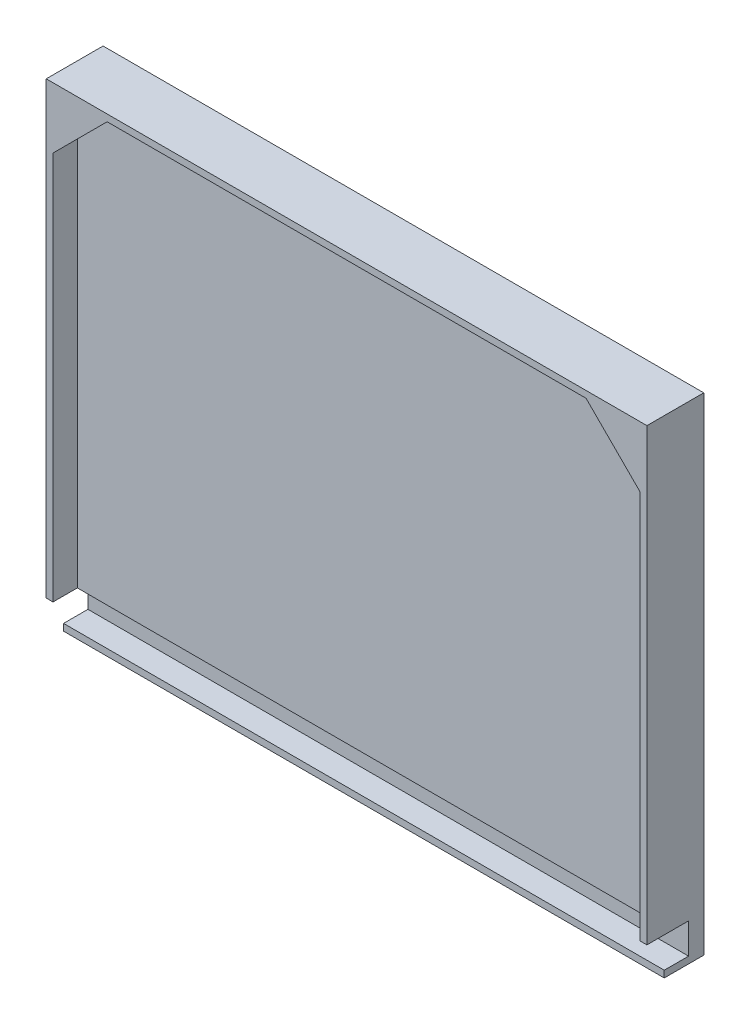
ISO-10303-21;
HEADER;
FILE_DESCRIPTION(('STEP AP214'),'2;1');
FILE_NAME('part.step','',(''),(''),'','','');
FILE_SCHEMA(('AUTOMOTIVE_DESIGN { 1 0 10303 214 1 1 1 1 }'));
ENDSEC;
DATA;
#1=APPLICATION_CONTEXT('core data for automotive mechanical design processes');
#2=APPLICATION_PROTOCOL_DEFINITION('international standard','automotive_design',2000,#1);
#3=PRODUCT_CONTEXT('',#1,'mechanical');
#4=PRODUCT('Part','Part','',(#3));
#5=PRODUCT_RELATED_PRODUCT_CATEGORY('part','',(#4));
#6=PRODUCT_DEFINITION_FORMATION('','',#4);
#7=PRODUCT_DEFINITION_CONTEXT('part definition',#1,'design');
#8=PRODUCT_DEFINITION('design','',#6,#7);
#9=PRODUCT_DEFINITION_SHAPE('','',#8);
#10=(LENGTH_UNIT() NAMED_UNIT(*) SI_UNIT(.MILLI.,.METRE.));
#11=(NAMED_UNIT(*) PLANE_ANGLE_UNIT() SI_UNIT($,.RADIAN.));
#12=(NAMED_UNIT(*) SI_UNIT($,.STERADIAN.) SOLID_ANGLE_UNIT());
#13=UNCERTAINTY_MEASURE_WITH_UNIT(LENGTH_MEASURE(1.E-05),#10,'distance_accuracy_value','');
#14=(GEOMETRIC_REPRESENTATION_CONTEXT(3) GLOBAL_UNCERTAINTY_ASSIGNED_CONTEXT((#13)) GLOBAL_UNIT_ASSIGNED_CONTEXT((#10,
#11,#12)) REPRESENTATION_CONTEXT('',''));
#15=CARTESIAN_POINT('',(0.,0.,0.));
#16=DIRECTION('',(0.,0.,1.));
#17=DIRECTION('',(1.,0.,0.));
#18=AXIS2_PLACEMENT_3D('',#15,#16,#17);
#19=CARTESIAN_POINT('',(-68.3631707317073,-94.7853658536585,17.272));
#20=DIRECTION('',(-1.,0.,0.));
#21=DIRECTION('',(0.,0.,1.));
#22=AXIS2_PLACEMENT_3D('',#19,#20,#21);
#23=PLANE('',#22);
#24=DIRECTION('',(0.,0.,-1.));
#25=VECTOR('',#24,1.);
#26=CARTESIAN_POINT('',(-68.3631707317073,-97.9603658536585,17.272));
#27=LINE('',#26,#25);
#28=CARTESIAN_POINT('',(-68.3631707317073,-97.9603658536585,18.542));
#29=VERTEX_POINT('',#28);
#30=CARTESIAN_POINT('',(-68.3631707317073,-97.9603658536585,0.));
#31=VERTEX_POINT('',#30);
#32=EDGE_CURVE('E370',#29,#31,#27,.T.);
#33=ORIENTED_EDGE('',*,*,#32,.F.);
#34=DIRECTION('',(0.,-1.,0.));
#35=VECTOR('',#34,1.);
#36=CARTESIAN_POINT('',(-68.3631707317073,-94.7853658536585,18.542));
#37=LINE('',#36,#35);
#38=CARTESIAN_POINT('',(-68.3631707317073,-94.7853658536585,18.542));
#39=VERTEX_POINT('',#38);
#40=EDGE_CURVE('E256',#39,#29,#37,.T.);
#41=ORIENTED_EDGE('',*,*,#40,.F.);
#42=DIRECTION('',(0.,0.,-1.));
#43=VECTOR('',#42,1.);
#44=CARTESIAN_POINT('',(-68.3631707317073,-94.7853658536585,17.272));
#45=LINE('',#44,#43);
#46=CARTESIAN_POINT('',(-68.3631707317073,-94.7853658536585,7.112));
#47=VERTEX_POINT('',#46);
#48=EDGE_CURVE('E369',#39,#47,#45,.T.);
#49=ORIENTED_EDGE('',*,*,#48,.T.);
#50=DIRECTION('',(0.,-1.,0.));
#51=VECTOR('',#50,1.);
#52=CARTESIAN_POINT('',(-68.3631707317073,-94.7853658536585,7.112));
#53=LINE('',#52,#51);
#54=CARTESIAN_POINT('',(-68.3631707317074,-80.4343658536585,7.112));
#55=VERTEX_POINT('',#54);
#56=EDGE_CURVE('E309',#55,#47,#53,.T.);
#57=ORIENTED_EDGE('',*,*,#56,.F.);
#58=DIRECTION('',(0.,0.,1.));
#59=VECTOR('',#58,1.);
#60=CARTESIAN_POINT('',(-68.3631707317074,-80.4343658536585,17.272));
#61=LINE('',#60,#59);
#62=CARTESIAN_POINT('',(-68.3631707317073,-80.4343658536585,26.67));
#63=VERTEX_POINT('',#62);
#64=EDGE_CURVE('E335',#55,#63,#61,.T.);
#65=ORIENTED_EDGE('',*,*,#64,.T.);
#66=DIRECTION('',(0.,-1.,0.));
#67=VECTOR('',#66,1.);
#68=CARTESIAN_POINT('',(-68.3631707317074,130.639634146342,26.67));
#69=LINE('',#68,#67);
#70=CARTESIAN_POINT('',(-68.3631707317074,130.639634146342,26.67));
#71=VERTEX_POINT('',#70);
#72=EDGE_CURVE('E265',#71,#63,#69,.T.);
#73=ORIENTED_EDGE('',*,*,#72,.F.);
#74=DIRECTION('',(0.,0.,-1.));
#75=VECTOR('',#74,1.);
#76=CARTESIAN_POINT('',(-68.3631707317074,130.639634146342,25.4));
#77=LINE('',#76,#75);
#78=CARTESIAN_POINT('',(-68.3631707317074,130.639634146342,0.));
#79=VERTEX_POINT('',#78);
#80=EDGE_CURVE('E358',#71,#79,#77,.T.);
#81=ORIENTED_EDGE('',*,*,#80,.T.);
#82=DIRECTION('',(0.,-1.,0.));
#83=VECTOR('',#82,1.);
#84=CARTESIAN_POINT('',(-68.3631707317074,130.639634146342,0.));
#85=LINE('',#84,#83);
#86=EDGE_CURVE('E339',#79,#31,#85,.T.);
#87=ORIENTED_EDGE('',*,*,#86,.T.);
#88=EDGE_LOOP('',(#33,#41,#49,#57,#65,#73,#81,#87));
#89=FACE_BOUND('',#88,.T.);
#90=ADVANCED_FACE('F48',(#89),#23,.T.);
#91=CARTESIAN_POINT('',(213.576829268293,-94.7853658536585,28.702));
#92=DIRECTION('',(1.,0.,0.));
#93=DIRECTION('',(0.,0.,-1.));
#94=AXIS2_PLACEMENT_3D('',#91,#92,#93);
#95=PLANE('',#94);
#96=DIRECTION('',(0.,0.,1.));
#97=VECTOR('',#96,1.);
#98=CARTESIAN_POINT('',(213.576829268293,-94.7853658536585,28.702));
#99=LINE('',#98,#97);
#100=CARTESIAN_POINT('',(213.576829268293,-94.7853658536585,7.112));
#101=VERTEX_POINT('',#100);
#102=CARTESIAN_POINT('',(213.576829268293,-94.7853658536585,18.542));
#103=VERTEX_POINT('',#102);
#104=EDGE_CURVE('E365',#101,#103,#99,.T.);
#105=ORIENTED_EDGE('',*,*,#104,.T.);
#106=DIRECTION('',(0.,1.,0.));
#107=VECTOR('',#106,1.);
#108=CARTESIAN_POINT('',(213.576829268293,-97.9603658536585,18.542));
#109=LINE('',#108,#107);
#110=CARTESIAN_POINT('',(213.576829268293,-97.9603658536585,18.542));
#111=VERTEX_POINT('',#110);
#112=EDGE_CURVE('E262',#111,#103,#109,.T.);
#113=ORIENTED_EDGE('',*,*,#112,.F.);
#114=DIRECTION('',(0.,0.,1.));
#115=VECTOR('',#114,1.);
#116=CARTESIAN_POINT('',(213.576829268293,-97.9603658536585,28.702));
#117=LINE('',#116,#115);
#118=CARTESIAN_POINT('',(213.576829268293,-97.9603658536585,0.));
#119=VERTEX_POINT('',#118);
#120=EDGE_CURVE('E364',#119,#111,#117,.T.);
#121=ORIENTED_EDGE('',*,*,#120,.F.);
#122=DIRECTION('',(0.,1.,0.));
#123=VECTOR('',#122,1.);
#124=CARTESIAN_POINT('',(213.576829268293,130.639634146342,0.));
#125=LINE('',#124,#123);
#126=CARTESIAN_POINT('',(213.576829268293,130.639634146342,0.));
#127=VERTEX_POINT('',#126);
#128=EDGE_CURVE('E350',#119,#127,#125,.T.);
#129=ORIENTED_EDGE('',*,*,#128,.T.);
#130=DIRECTION('',(0.,0.,-1.));
#131=VECTOR('',#130,1.);
#132=CARTESIAN_POINT('',(213.576829268293,130.639634146342,25.4));
#133=LINE('',#132,#131);
#134=CARTESIAN_POINT('',(213.576829268293,130.639634146342,26.67));
#135=VERTEX_POINT('',#134);
#136=EDGE_CURVE('E361',#135,#127,#133,.T.);
#137=ORIENTED_EDGE('',*,*,#136,.F.);
#138=DIRECTION('',(0.,1.,0.));
#139=VECTOR('',#138,1.);
#140=CARTESIAN_POINT('',(213.576829268293,-80.4343658536585,26.67));
#141=LINE('',#140,#139);
#142=CARTESIAN_POINT('',(213.576829268293,-80.4343658536585,26.67));
#143=VERTEX_POINT('',#142);
#144=EDGE_CURVE('E283',#143,#135,#141,.T.);
#145=ORIENTED_EDGE('',*,*,#144,.F.);
#146=DIRECTION('',(0.,0.,1.));
#147=VECTOR('',#146,1.);
#148=CARTESIAN_POINT('',(213.576829268293,-80.4343658536585,17.272));
#149=LINE('',#148,#147);
#150=CARTESIAN_POINT('',(213.576829268293,-80.4343658536585,7.112));
#151=VERTEX_POINT('',#150);
#152=EDGE_CURVE('E334',#151,#143,#149,.T.);
#153=ORIENTED_EDGE('',*,*,#152,.F.);
#154=DIRECTION('',(0.,1.,0.));
#155=VECTOR('',#154,1.);
#156=CARTESIAN_POINT('',(213.576829268293,-80.4343658536585,7.112));
#157=LINE('',#156,#155);
#158=EDGE_CURVE('E317',#101,#151,#157,.T.);
#159=ORIENTED_EDGE('',*,*,#158,.F.);
#160=EDGE_LOOP('',(#105,#113,#121,#129,#137,#145,#153,#159));
#161=FACE_BOUND('',#160,.T.);
#162=ADVANCED_FACE('F483',(#161),#95,.T.);
#163=CARTESIAN_POINT('',(0.,-94.7853658536585,0.));
#164=DIRECTION('',(0.,1.,0.));
#165=DIRECTION('',(0.,0.,1.));
#166=AXIS2_PLACEMENT_3D('',#163,#164,#165);
#167=PLANE('',#166);
#168=ORIENTED_EDGE('',*,*,#48,.F.);
#169=DIRECTION('',(-1.,0.,0.));
#170=VECTOR('',#169,1.);
#171=CARTESIAN_POINT('',(213.576829268293,-94.7853658536585,18.542));
#172=LINE('',#171,#170);
#173=EDGE_CURVE('E250',#103,#39,#172,.T.);
#174=ORIENTED_EDGE('',*,*,#173,.F.);
#175=ORIENTED_EDGE('',*,*,#104,.F.);
#176=DIRECTION('',(1.,0.,0.));
#177=VECTOR('',#176,1.);
#178=CARTESIAN_POINT('',(213.576829268293,-94.7853658536585,7.112));
#179=LINE('',#178,#177);
#180=EDGE_CURVE('E313',#47,#101,#179,.T.);
#181=ORIENTED_EDGE('',*,*,#180,.F.);
#182=EDGE_LOOP('',(#168,#174,#175,#181));
#183=FACE_BOUND('',#182,.T.);
#184=ADVANCED_FACE('F486',(#183),#167,.T.);
#185=CARTESIAN_POINT('',(0.,-97.9603658536585,0.));
#186=DIRECTION('',(0.,1.,0.));
#187=DIRECTION('',(0.,0.,1.));
#188=AXIS2_PLACEMENT_3D('',#185,#186,#187);
#189=PLANE('',#188);
#190=DIRECTION('',(1.,0.,0.));
#191=VECTOR('',#190,1.);
#192=CARTESIAN_POINT('',(-68.3631707317073,-97.9603658536585,18.542));
#193=LINE('',#192,#191);
#194=EDGE_CURVE('E259',#29,#111,#193,.T.);
#195=ORIENTED_EDGE('',*,*,#194,.F.);
#196=ORIENTED_EDGE('',*,*,#32,.T.);
#197=DIRECTION('',(1.,0.,0.));
#198=VECTOR('',#197,1.);
#199=CARTESIAN_POINT('',(-68.3631707317073,-97.9603658536585,0.));
#200=LINE('',#199,#198);
#201=EDGE_CURVE('E346',#31,#119,#200,.T.);
#202=ORIENTED_EDGE('',*,*,#201,.T.);
#203=ORIENTED_EDGE('',*,*,#120,.T.);
#204=EDGE_LOOP('',(#195,#196,#202,#203));
#205=FACE_BOUND('',#204,.T.);
#206=ADVANCED_FACE('F491',(#205),#189,.F.);
#207=CARTESIAN_POINT('',(-68.3631707317074,130.639634146342,25.4));
#208=DIRECTION('',(0.,-1.,0.));
#209=DIRECTION('',(1.,0.,0.));
#210=AXIS2_PLACEMENT_3D('',#207,#208,#209);
#211=PLANE('',#210);
#212=DIRECTION('',(-1.,0.,0.));
#213=VECTOR('',#212,1.);
#214=CARTESIAN_POINT('',(213.576829268293,130.639634146342,26.67));
#215=LINE('',#214,#213);
#216=EDGE_CURVE('E286',#135,#71,#215,.T.);
#217=ORIENTED_EDGE('',*,*,#216,.F.);
#218=ORIENTED_EDGE('',*,*,#136,.T.);
#219=DIRECTION('',(-1.,0.,0.));
#220=VECTOR('',#219,1.);
#221=CARTESIAN_POINT('',(-68.3631707317074,130.639634146342,0.));
#222=LINE('',#221,#220);
#223=EDGE_CURVE('E354',#127,#79,#222,.T.);
#224=ORIENTED_EDGE('',*,*,#223,.T.);
#225=ORIENTED_EDGE('',*,*,#80,.F.);
#226=EDGE_LOOP('',(#217,#218,#224,#225));
#227=FACE_BOUND('',#226,.T.);
#228=ADVANCED_FACE('F494',(#227),#211,.F.);
#229=CARTESIAN_POINT('',(-68.3631707317074,-80.4343658536585,17.272));
#230=DIRECTION('',(0.,1.,0.));
#231=DIRECTION('',(0.,0.,1.));
#232=AXIS2_PLACEMENT_3D('',#229,#230,#231);
#233=PLANE('',#232);
#234=DIRECTION('',(1.,0.,0.));
#235=VECTOR('',#234,1.);
#236=CARTESIAN_POINT('',(-68.3631707317073,-80.4343658536585,26.67));
#237=LINE('',#236,#235);
#238=CARTESIAN_POINT('',(-65.1881707317073,-80.4343658536585,26.67));
#239=VERTEX_POINT('',#238);
#240=EDGE_CURVE('E268',#63,#239,#237,.T.);
#241=ORIENTED_EDGE('',*,*,#240,.F.);
#242=ORIENTED_EDGE('',*,*,#64,.F.);
#243=DIRECTION('',(-1.,0.,0.));
#244=VECTOR('',#243,1.);
#245=CARTESIAN_POINT('',(-68.3631707317074,-80.4343658536585,7.112));
#246=LINE('',#245,#244);
#247=EDGE_CURVE('E305',#151,#55,#246,.T.);
#248=ORIENTED_EDGE('',*,*,#247,.F.);
#249=ORIENTED_EDGE('',*,*,#152,.T.);
#250=DIRECTION('',(1.,0.,0.));
#251=VECTOR('',#250,1.);
#252=CARTESIAN_POINT('',(210.401829268293,-80.4343658536585,26.67));
#253=LINE('',#252,#251);
#254=CARTESIAN_POINT('',(210.401829268293,-80.4343658536585,26.67));
#255=VERTEX_POINT('',#254);
#256=EDGE_CURVE('E280',#255,#143,#253,.T.);
#257=ORIENTED_EDGE('',*,*,#256,.F.);
#258=DIRECTION('',(0.,0.,-1.));
#259=VECTOR('',#258,1.);
#260=CARTESIAN_POINT('',(210.401829268293,-80.4343658536585,25.4));
#261=LINE('',#260,#259);
#262=CARTESIAN_POINT('',(210.401829268293,-80.4343658536585,15.24));
#263=VERTEX_POINT('',#262);
#264=EDGE_CURVE('E325',#255,#263,#261,.T.);
#265=ORIENTED_EDGE('',*,*,#264,.T.);
#266=DIRECTION('',(1.,0.,0.));
#267=VECTOR('',#266,1.);
#268=CARTESIAN_POINT('',(210.401829268293,-80.4343658536585,15.24));
#269=LINE('',#268,#267);
#270=CARTESIAN_POINT('',(-65.1881707317073,-80.4343658536585,15.24));
#271=VERTEX_POINT('',#270);
#272=EDGE_CURVE('E297',#271,#263,#269,.T.);
#273=ORIENTED_EDGE('',*,*,#272,.F.);
#274=DIRECTION('',(0.,0.,1.));
#275=VECTOR('',#274,1.);
#276=CARTESIAN_POINT('',(-65.1881707317073,-80.4343658536585,36.83));
#277=LINE('',#276,#275);
#278=EDGE_CURVE('E328',#271,#239,#277,.T.);
#279=ORIENTED_EDGE('',*,*,#278,.T.);
#280=EDGE_LOOP('',(#241,#242,#248,#249,#257,#265,#273,#279));
#281=FACE_BOUND('',#280,.T.);
#282=ADVANCED_FACE('F501',(#281),#233,.F.);
#283=CARTESIAN_POINT('',(0.,127.464634146342,0.));
#284=DIRECTION('',(0.,-1.,0.));
#285=DIRECTION('',(1.,0.,0.));
#286=AXIS2_PLACEMENT_3D('',#283,#284,#285);
#287=PLANE('',#286);
#288=DIRECTION('',(0.,0.,1.));
#289=VECTOR('',#288,1.);
#290=CARTESIAN_POINT('',(-39.7881707317074,127.464634146342,23.495));
#291=LINE('',#290,#289);
#292=CARTESIAN_POINT('',(-39.7881707317074,127.464634146342,23.495));
#293=VERTEX_POINT('',#292);
#294=CARTESIAN_POINT('',(-39.7881707317074,127.464634146342,26.67));
#295=VERTEX_POINT('',#294);
#296=EDGE_CURVE('E208',#293,#295,#291,.T.);
#297=ORIENTED_EDGE('',*,*,#296,.F.);
#298=DIRECTION('',(-1.,0.,0.));
#299=VECTOR('',#298,1.);
#300=CARTESIAN_POINT('',(-39.7881707317074,127.464634146342,23.495));
#301=LINE('',#300,#299);
#302=CARTESIAN_POINT('',(-65.1881707317074,127.464634146342,23.495));
#303=VERTEX_POINT('',#302);
#304=EDGE_CURVE('E209',#293,#303,#301,.T.);
#305=ORIENTED_EDGE('',*,*,#304,.T.);
#306=DIRECTION('',(0.,0.,1.));
#307=VECTOR('',#306,1.);
#308=CARTESIAN_POINT('',(-65.1881707317074,127.464634146342,36.83));
#309=LINE('',#308,#307);
#310=CARTESIAN_POINT('',(-65.1881707317074,127.464634146342,15.24));
#311=VERTEX_POINT('',#310);
#312=EDGE_CURVE('E221',#311,#303,#309,.T.);
#313=ORIENTED_EDGE('',*,*,#312,.F.);
#314=DIRECTION('',(-1.,0.,0.));
#315=VECTOR('',#314,1.);
#316=CARTESIAN_POINT('',(-65.1881707317074,127.464634146342,15.24));
#317=LINE('',#316,#315);
#318=CARTESIAN_POINT('',(210.401829268293,127.464634146342,15.24));
#319=VERTEX_POINT('',#318);
#320=EDGE_CURVE('E289',#319,#311,#317,.T.);
#321=ORIENTED_EDGE('',*,*,#320,.F.);
#322=DIRECTION('',(0.,0.,1.));
#323=VECTOR('',#322,1.);
#324=CARTESIAN_POINT('',(210.401829268293,127.464634146342,36.83));
#325=LINE('',#324,#323);
#326=CARTESIAN_POINT('',(210.401829268293,127.464634146342,23.495));
#327=VERTEX_POINT('',#326);
#328=EDGE_CURVE('E321',#319,#327,#325,.T.);
#329=ORIENTED_EDGE('',*,*,#328,.T.);
#330=DIRECTION('',(-1.,0.,0.));
#331=VECTOR('',#330,1.);
#332=CARTESIAN_POINT('',(210.401829268293,127.464634146342,23.495));
#333=LINE('',#332,#331);
#334=CARTESIAN_POINT('',(185.001829268293,127.464634146342,23.495));
#335=VERTEX_POINT('',#334);
#336=EDGE_CURVE('E233',#327,#335,#333,.T.);
#337=ORIENTED_EDGE('',*,*,#336,.T.);
#338=DIRECTION('',(0.,0.,1.));
#339=VECTOR('',#338,1.);
#340=CARTESIAN_POINT('',(185.001829268293,127.464634146342,23.495));
#341=LINE('',#340,#339);
#342=CARTESIAN_POINT('',(185.001829268293,127.464634146342,26.67));
#343=VERTEX_POINT('',#342);
#344=EDGE_CURVE('E244',#335,#343,#341,.T.);
#345=ORIENTED_EDGE('',*,*,#344,.T.);
#346=DIRECTION('',(1.,0.,0.));
#347=VECTOR('',#346,1.);
#348=CARTESIAN_POINT('',(-65.1881707317074,127.464634146342,26.67));
#349=LINE('',#348,#347);
#350=EDGE_CURVE('E274',#295,#343,#349,.T.);
#351=ORIENTED_EDGE('',*,*,#350,.F.);
#352=EDGE_LOOP('',(#297,#305,#313,#321,#329,#337,#345,#351));
#353=FACE_BOUND('',#352,.T.);
#354=ADVANCED_FACE('F511',(#353),#287,.T.);
#355=CARTESIAN_POINT('',(-65.1881707317074,0.,0.));
#356=DIRECTION('',(1.,0.,0.));
#357=DIRECTION('',(0.,1.,0.));
#358=AXIS2_PLACEMENT_3D('',#355,#356,#357);
#359=PLANE('',#358);
#360=DIRECTION('',(0.,0.,1.));
#361=VECTOR('',#360,1.);
#362=CARTESIAN_POINT('',(-65.1881707317074,102.064634146342,23.495));
#363=LINE('',#362,#361);
#364=CARTESIAN_POINT('',(-65.1881707317074,102.064634146342,23.495));
#365=VERTEX_POINT('',#364);
#366=CARTESIAN_POINT('',(-65.1881707317074,102.064634146342,26.67));
#367=VERTEX_POINT('',#366);
#368=EDGE_CURVE('E199',#365,#367,#363,.T.);
#369=ORIENTED_EDGE('',*,*,#368,.T.);
#370=DIRECTION('',(0.,1.,0.));
#371=VECTOR('',#370,1.);
#372=CARTESIAN_POINT('',(-65.1881707317073,-80.4343658536585,26.67));
#373=LINE('',#372,#371);
#374=EDGE_CURVE('E271',#239,#367,#373,.T.);
#375=ORIENTED_EDGE('',*,*,#374,.F.);
#376=ORIENTED_EDGE('',*,*,#278,.F.);
#377=DIRECTION('',(0.,-1.,0.));
#378=VECTOR('',#377,1.);
#379=CARTESIAN_POINT('',(-65.1881707317073,-80.4343658536585,15.24));
#380=LINE('',#379,#378);
#381=EDGE_CURVE('E293',#311,#271,#380,.T.);
#382=ORIENTED_EDGE('',*,*,#381,.F.);
#383=ORIENTED_EDGE('',*,*,#312,.T.);
#384=DIRECTION('',(0.,-1.,0.));
#385=VECTOR('',#384,1.);
#386=CARTESIAN_POINT('',(-65.1881707317074,127.464634146342,23.495));
#387=LINE('',#386,#385);
#388=EDGE_CURVE('E213',#303,#365,#387,.T.);
#389=ORIENTED_EDGE('',*,*,#388,.T.);
#390=EDGE_LOOP('',(#369,#375,#376,#382,#383,#389));
#391=FACE_BOUND('',#390,.T.);
#392=ADVANCED_FACE('F219',(#391),#359,.T.);
#393=CARTESIAN_POINT('',(210.401829268293,0.,0.));
#394=DIRECTION('',(-1.,0.,0.));
#395=DIRECTION('',(0.,0.,1.));
#396=AXIS2_PLACEMENT_3D('',#393,#394,#395);
#397=PLANE('',#396);
#398=DIRECTION('',(0.,0.,1.));
#399=VECTOR('',#398,1.);
#400=CARTESIAN_POINT('',(210.401829268293,102.064634146342,23.495));
#401=LINE('',#400,#399);
#402=CARTESIAN_POINT('',(210.401829268293,102.064634146342,23.495));
#403=VERTEX_POINT('',#402);
#404=CARTESIAN_POINT('',(210.401829268293,102.064634146342,26.67));
#405=VERTEX_POINT('',#404);
#406=EDGE_CURVE('E247',#403,#405,#401,.T.);
#407=ORIENTED_EDGE('',*,*,#406,.F.);
#408=DIRECTION('',(0.,1.,0.));
#409=VECTOR('',#408,1.);
#410=CARTESIAN_POINT('',(210.401829268293,102.064634146342,23.495));
#411=LINE('',#410,#409);
#412=EDGE_CURVE('E240',#403,#327,#411,.T.);
#413=ORIENTED_EDGE('',*,*,#412,.T.);
#414=ORIENTED_EDGE('',*,*,#328,.F.);
#415=DIRECTION('',(0.,1.,0.));
#416=VECTOR('',#415,1.);
#417=CARTESIAN_POINT('',(210.401829268293,127.464634146342,15.24));
#418=LINE('',#417,#416);
#419=EDGE_CURVE('E301',#263,#319,#418,.T.);
#420=ORIENTED_EDGE('',*,*,#419,.F.);
#421=ORIENTED_EDGE('',*,*,#264,.F.);
#422=DIRECTION('',(0.,-1.,0.));
#423=VECTOR('',#422,1.);
#424=CARTESIAN_POINT('',(210.401829268293,127.464634146342,26.67));
#425=LINE('',#424,#423);
#426=EDGE_CURVE('E277',#405,#255,#425,.T.);
#427=ORIENTED_EDGE('',*,*,#426,.F.);
#428=EDGE_LOOP('',(#407,#413,#414,#420,#421,#427));
#429=FACE_BOUND('',#428,.T.);
#430=ADVANCED_FACE('F507',(#429),#397,.T.);
#431=CARTESIAN_POINT('',(0.,0.,0.));
#432=DIRECTION('',(0.,0.,1.));
#433=DIRECTION('',(1.,0.,0.));
#434=AXIS2_PLACEMENT_3D('',#431,#432,#433);
#435=PLANE('',#434);
#436=ORIENTED_EDGE('',*,*,#86,.F.);
#437=ORIENTED_EDGE('',*,*,#223,.F.);
#438=ORIENTED_EDGE('',*,*,#128,.F.);
#439=ORIENTED_EDGE('',*,*,#201,.F.);
#440=EDGE_LOOP('',(#436,#437,#438,#439));
#441=FACE_BOUND('',#440,.T.);
#442=ADVANCED_FACE('F503',(#441),#435,.F.);
#443=CARTESIAN_POINT('',(0.,0.,7.112));
#444=DIRECTION('',(0.,0.,-1.));
#445=DIRECTION('',(-1.,0.,0.));
#446=AXIS2_PLACEMENT_3D('',#443,#444,#445);
#447=PLANE('',#446);
#448=ORIENTED_EDGE('',*,*,#247,.T.);
#449=ORIENTED_EDGE('',*,*,#56,.T.);
#450=ORIENTED_EDGE('',*,*,#180,.T.);
#451=ORIENTED_EDGE('',*,*,#158,.T.);
#452=EDGE_LOOP('',(#448,#449,#450,#451));
#453=FACE_BOUND('',#452,.T.);
#454=ADVANCED_FACE('F506',(#453),#447,.F.);
#455=CARTESIAN_POINT('',(0.,0.,15.24));
#456=DIRECTION('',(0.,0.,-1.));
#457=DIRECTION('',(-1.,0.,0.));
#458=AXIS2_PLACEMENT_3D('',#455,#456,#457);
#459=PLANE('',#458);
#460=ORIENTED_EDGE('',*,*,#320,.T.);
#461=ORIENTED_EDGE('',*,*,#381,.T.);
#462=ORIENTED_EDGE('',*,*,#272,.T.);
#463=ORIENTED_EDGE('',*,*,#419,.T.);
#464=EDGE_LOOP('',(#460,#461,#462,#463));
#465=FACE_BOUND('',#464,.T.);
#466=ADVANCED_FACE('F523',(#465),#459,.F.);
#467=CARTESIAN_POINT('',(0.,0.,26.67));
#468=DIRECTION('',(0.,0.,1.));
#469=DIRECTION('',(1.,0.,0.));
#470=AXIS2_PLACEMENT_3D('',#467,#468,#469);
#471=PLANE('',#470);
#472=ORIENTED_EDGE('',*,*,#374,.T.);
#473=DIRECTION('',(0.707106781186547,0.707106781186548,0.));
#474=VECTOR('',#473,1.);
#475=CARTESIAN_POINT('',(-65.1881707317074,102.064634146342,26.67));
#476=LINE('',#475,#474);
#477=EDGE_CURVE('E67',#367,#295,#476,.T.);
#478=ORIENTED_EDGE('',*,*,#477,.T.);
#479=ORIENTED_EDGE('',*,*,#350,.T.);
#480=DIRECTION('',(0.707106781186549,-0.707106781186546,0.));
#481=VECTOR('',#480,1.);
#482=CARTESIAN_POINT('',(185.001829268293,127.464634146342,26.67));
#483=LINE('',#482,#481);
#484=EDGE_CURVE('E73',#343,#405,#483,.T.);
#485=ORIENTED_EDGE('',*,*,#484,.T.);
#486=ORIENTED_EDGE('',*,*,#426,.T.);
#487=ORIENTED_EDGE('',*,*,#256,.T.);
#488=ORIENTED_EDGE('',*,*,#144,.T.);
#489=ORIENTED_EDGE('',*,*,#216,.T.);
#490=ORIENTED_EDGE('',*,*,#72,.T.);
#491=ORIENTED_EDGE('',*,*,#240,.T.);
#492=EDGE_LOOP('',(#472,#478,#479,#485,#486,#487,#488,#489,#490,#491));
#493=FACE_BOUND('',#492,.T.);
#494=ADVANCED_FACE('F527',(#493),#471,.T.);
#495=CARTESIAN_POINT('',(0.,0.,18.542));
#496=DIRECTION('',(0.,0.,1.));
#497=DIRECTION('',(1.,0.,0.));
#498=AXIS2_PLACEMENT_3D('',#495,#496,#497);
#499=PLANE('',#498);
#500=ORIENTED_EDGE('',*,*,#173,.T.);
#501=ORIENTED_EDGE('',*,*,#40,.T.);
#502=ORIENTED_EDGE('',*,*,#194,.T.);
#503=ORIENTED_EDGE('',*,*,#112,.T.);
#504=EDGE_LOOP('',(#500,#501,#502,#503));
#505=FACE_BOUND('',#504,.T.);
#506=ADVANCED_FACE('F531',(#505),#499,.T.);
#507=CARTESIAN_POINT('',(185.001829268293,127.464634146342,23.495));
#508=DIRECTION('',(-0.707106781186546,-0.707106781186549,0.));
#509=DIRECTION('',(0.707106781186549,-0.707106781186546,0.));
#510=AXIS2_PLACEMENT_3D('',#507,#508,#509);
#511=PLANE('',#510);
#512=ORIENTED_EDGE('',*,*,#484,.F.);
#513=ORIENTED_EDGE('',*,*,#344,.F.);
#514=DIRECTION('',(0.707106781186549,-0.707106781186546,0.));
#515=VECTOR('',#514,1.);
#516=CARTESIAN_POINT('',(185.001829268293,127.464634146342,23.495));
#517=LINE('',#516,#515);
#518=EDGE_CURVE('E237',#335,#403,#517,.T.);
#519=ORIENTED_EDGE('',*,*,#518,.T.);
#520=ORIENTED_EDGE('',*,*,#406,.T.);
#521=EDGE_LOOP('',(#512,#513,#519,#520));
#522=FACE_BOUND('',#521,.T.);
#523=ADVANCED_FACE('F534',(#522),#511,.T.);
#524=CARTESIAN_POINT('',(0.,0.,23.495));
#525=DIRECTION('',(0.,0.,-1.));
#526=DIRECTION('',(-1.,0.,0.));
#527=AXIS2_PLACEMENT_3D('',#524,#525,#526);
#528=PLANE('',#527);
#529=ORIENTED_EDGE('',*,*,#336,.F.);
#530=ORIENTED_EDGE('',*,*,#412,.F.);
#531=ORIENTED_EDGE('',*,*,#518,.F.);
#532=EDGE_LOOP('',(#529,#530,#531));
#533=FACE_BOUND('',#532,.T.);
#534=ADVANCED_FACE('F538',(#533),#528,.T.);
#535=CARTESIAN_POINT('',(-65.1881707317074,102.064634146342,23.495));
#536=DIRECTION('',(0.707106781186548,-0.707106781186547,0.));
#537=DIRECTION('',(0.707106781186547,0.707106781186548,0.));
#538=AXIS2_PLACEMENT_3D('',#535,#536,#537);
#539=PLANE('',#538);
#540=ORIENTED_EDGE('',*,*,#477,.F.);
#541=ORIENTED_EDGE('',*,*,#368,.F.);
#542=DIRECTION('',(0.707106781186547,0.707106781186548,0.));
#543=VECTOR('',#542,1.);
#544=CARTESIAN_POINT('',(-65.1881707317074,102.064634146342,23.495));
#545=LINE('',#544,#543);
#546=EDGE_CURVE('E202',#365,#293,#545,.T.);
#547=ORIENTED_EDGE('',*,*,#546,.T.);
#548=ORIENTED_EDGE('',*,*,#296,.T.);
#549=EDGE_LOOP('',(#540,#541,#547,#548));
#550=FACE_BOUND('',#549,.T.);
#551=ADVANCED_FACE('F201',(#550),#539,.T.);
#552=CARTESIAN_POINT('',(0.,0.,23.495));
#553=DIRECTION('',(0.,0.,-1.));
#554=DIRECTION('',(-1.,0.,0.));
#555=AXIS2_PLACEMENT_3D('',#552,#553,#554);
#556=PLANE('',#555);
#557=ORIENTED_EDGE('',*,*,#388,.F.);
#558=ORIENTED_EDGE('',*,*,#304,.F.);
#559=ORIENTED_EDGE('',*,*,#546,.F.);
#560=EDGE_LOOP('',(#557,#558,#559));
#561=FACE_BOUND('',#560,.T.);
#562=ADVANCED_FACE('F212',(#561),#556,.T.);
#563=CLOSED_SHELL('',(#90,#162,#184,#206,#228,#282,#354,#392,#430,#442,#454,#466,#494,#506,#523,
#534,#551,#562));
#564=CARTESIAN_POINT('',(-65.8231707317073,-94.7853658536585,17.272));
#565=DIRECTION('',(-1.,0.,0.));
#566=DIRECTION('',(0.,0.,1.));
#567=AXIS2_PLACEMENT_3D('',#564,#565,#566);
#568=PLANE('',#567);
#569=DIRECTION('',(0.,0.,1.));
#570=VECTOR('',#569,1.);
#571=CARTESIAN_POINT('',(-65.8231707317073,-77.8943658536585,17.272));
#572=LINE('',#571,#570);
#573=CARTESIAN_POINT('',(-65.8231707317073,-77.8943658536585,4.572));
#574=VERTEX_POINT('',#573);
#575=CARTESIAN_POINT('',(-65.8231707317073,-77.8943658536585,12.7));
#576=VERTEX_POINT('',#575);
#577=EDGE_CURVE('E52',#574,#576,#572,.T.);
#578=ORIENTED_EDGE('',*,*,#577,.F.);
#579=DIRECTION('',(0.,-1.,0.));
#580=VECTOR('',#579,1.);
#581=CARTESIAN_POINT('',(-65.8231707317073,-94.7853658536585,4.572));
#582=LINE('',#581,#580);
#583=CARTESIAN_POINT('',(-65.8231707317073,-95.4203658536585,4.572));
#584=VERTEX_POINT('',#583);
#585=EDGE_CURVE('E381',#574,#584,#582,.T.);
#586=ORIENTED_EDGE('',*,*,#585,.T.);
#587=DIRECTION('',(0.,0.,-1.));
#588=VECTOR('',#587,1.);
#589=CARTESIAN_POINT('',(-65.8231707317073,-95.4203658536585,17.272));
#590=LINE('',#589,#588);
#591=CARTESIAN_POINT('',(-65.8231707317073,-95.4203658536585,2.54));
#592=VERTEX_POINT('',#591);
#593=EDGE_CURVE('E408',#584,#592,#590,.T.);
#594=ORIENTED_EDGE('',*,*,#593,.T.);
#595=DIRECTION('',(0.,-1.,0.));
#596=VECTOR('',#595,1.);
#597=CARTESIAN_POINT('',(-65.8231707317073,0.,2.54));
#598=LINE('',#597,#596);
#599=CARTESIAN_POINT('',(-65.8231707317073,128.099634146342,2.54));
#600=VERTEX_POINT('',#599);
#601=EDGE_CURVE('E425',#600,#592,#598,.T.);
#602=ORIENTED_EDGE('',*,*,#601,.F.);
#603=DIRECTION('',(0.,0.,-1.));
#604=VECTOR('',#603,1.);
#605=CARTESIAN_POINT('',(-65.8231707317073,128.099634146342,25.4));
#606=LINE('',#605,#604);
#607=CARTESIAN_POINT('',(-65.8231707317073,128.099634146342,12.7));
#608=VERTEX_POINT('',#607);
#609=EDGE_CURVE('E429',#608,#600,#606,.T.);
#610=ORIENTED_EDGE('',*,*,#609,.F.);
#611=DIRECTION('',(0.,1.,0.));
#612=VECTOR('',#611,1.);
#613=CARTESIAN_POINT('',(-65.8231707317073,0.,12.7));
#614=LINE('',#613,#612);
#615=EDGE_CURVE('E431',#576,#608,#614,.T.);
#616=ORIENTED_EDGE('',*,*,#615,.F.);
#617=EDGE_LOOP('',(#578,#586,#594,#602,#610,#616));
#618=FACE_BOUND('',#617,.T.);
#619=ADVANCED_FACE('F455',(#618),#568,.F.);
#620=CARTESIAN_POINT('',(211.036829268293,-94.7853658536585,28.702));
#621=DIRECTION('',(1.,0.,0.));
#622=DIRECTION('',(0.,0.,-1.));
#623=AXIS2_PLACEMENT_3D('',#620,#621,#622);
#624=PLANE('',#623);
#625=DIRECTION('',(0.,0.,-1.));
#626=VECTOR('',#625,1.);
#627=CARTESIAN_POINT('',(211.036829268293,128.099634146342,28.702));
#628=LINE('',#627,#626);
#629=CARTESIAN_POINT('',(211.036829268293,128.099634146342,12.7));
#630=VERTEX_POINT('',#629);
#631=CARTESIAN_POINT('',(211.036829268293,128.099634146342,2.54));
#632=VERTEX_POINT('',#631);
#633=EDGE_CURVE('E401',#630,#632,#628,.T.);
#634=ORIENTED_EDGE('',*,*,#633,.T.);
#635=DIRECTION('',(0.,1.,0.));
#636=VECTOR('',#635,1.);
#637=CARTESIAN_POINT('',(211.036829268293,0.,2.54));
#638=LINE('',#637,#636);
#639=CARTESIAN_POINT('',(211.036829268293,-95.4203658536585,2.54));
#640=VERTEX_POINT('',#639);
#641=EDGE_CURVE('E418',#640,#632,#638,.T.);
#642=ORIENTED_EDGE('',*,*,#641,.F.);
#643=DIRECTION('',(0.,0.,1.));
#644=VECTOR('',#643,1.);
#645=CARTESIAN_POINT('',(211.036829268293,-95.4203658536585,28.702));
#646=LINE('',#645,#644);
#647=CARTESIAN_POINT('',(211.036829268293,-95.4203658536585,4.572));
#648=VERTEX_POINT('',#647);
#649=EDGE_CURVE('E414',#640,#648,#646,.T.);
#650=ORIENTED_EDGE('',*,*,#649,.T.);
#651=DIRECTION('',(0.,1.,0.));
#652=VECTOR('',#651,1.);
#653=CARTESIAN_POINT('',(211.036829268293,-94.7853658536585,4.572));
#654=LINE('',#653,#652);
#655=CARTESIAN_POINT('',(211.036829268293,-77.8943658536585,4.572));
#656=VERTEX_POINT('',#655);
#657=EDGE_CURVE('E389',#648,#656,#654,.T.);
#658=ORIENTED_EDGE('',*,*,#657,.T.);
#659=DIRECTION('',(0.,0.,1.));
#660=VECTOR('',#659,1.);
#661=CARTESIAN_POINT('',(211.036829268293,-77.8943658536585,28.702));
#662=LINE('',#661,#660);
#663=CARTESIAN_POINT('',(211.036829268293,-77.8943658536585,12.7));
#664=VERTEX_POINT('',#663);
#665=EDGE_CURVE('E393',#656,#664,#662,.T.);
#666=ORIENTED_EDGE('',*,*,#665,.T.);
#667=DIRECTION('',(0.,-1.,0.));
#668=VECTOR('',#667,1.);
#669=CARTESIAN_POINT('',(211.036829268293,0.,12.7));
#670=LINE('',#669,#668);
#671=EDGE_CURVE('E422',#630,#664,#670,.T.);
#672=ORIENTED_EDGE('',*,*,#671,.F.);
#673=EDGE_LOOP('',(#634,#642,#650,#658,#666,#672));
#674=FACE_BOUND('',#673,.T.);
#675=ADVANCED_FACE('F449',(#674),#624,.F.);
#676=CARTESIAN_POINT('',(0.,-95.4203658536585,0.));
#677=DIRECTION('',(0.,1.,0.));
#678=DIRECTION('',(0.,0.,1.));
#679=AXIS2_PLACEMENT_3D('',#676,#677,#678);
#680=PLANE('',#679);
#681=ORIENTED_EDGE('',*,*,#649,.F.);
#682=DIRECTION('',(1.,0.,0.));
#683=VECTOR('',#682,1.);
#684=CARTESIAN_POINT('',(0.,-95.4203658536585,2.54));
#685=LINE('',#684,#683);
#686=EDGE_CURVE('E404',#592,#640,#685,.T.);
#687=ORIENTED_EDGE('',*,*,#686,.F.);
#688=ORIENTED_EDGE('',*,*,#593,.F.);
#689=DIRECTION('',(-1.,0.,0.));
#690=VECTOR('',#689,1.);
#691=CARTESIAN_POINT('',(0.,-95.4203658536585,4.572));
#692=LINE('',#691,#690);
#693=EDGE_CURVE('E411',#648,#584,#692,.T.);
#694=ORIENTED_EDGE('',*,*,#693,.F.);
#695=EDGE_LOOP('',(#681,#687,#688,#694));
#696=FACE_BOUND('',#695,.T.);
#697=ADVANCED_FACE('F459',(#696),#680,.T.);
#698=CARTESIAN_POINT('',(-68.3631707317074,128.099634146342,25.4));
#699=DIRECTION('',(0.,-1.,0.));
#700=DIRECTION('',(1.,0.,0.));
#701=AXIS2_PLACEMENT_3D('',#698,#699,#700);
#702=PLANE('',#701);
#703=DIRECTION('',(-1.,0.,0.));
#704=VECTOR('',#703,1.);
#705=CARTESIAN_POINT('',(0.,128.099634146342,12.7));
#706=LINE('',#705,#704);
#707=EDGE_CURVE('E59',#630,#608,#706,.T.);
#708=ORIENTED_EDGE('',*,*,#707,.T.);
#709=ORIENTED_EDGE('',*,*,#609,.T.);
#710=DIRECTION('',(-1.,0.,0.));
#711=VECTOR('',#710,1.);
#712=CARTESIAN_POINT('',(-68.3631707317074,128.099634146342,2.54));
#713=LINE('',#712,#711);
#714=EDGE_CURVE('E397',#632,#600,#713,.T.);
#715=ORIENTED_EDGE('',*,*,#714,.F.);
#716=ORIENTED_EDGE('',*,*,#633,.F.);
#717=EDGE_LOOP('',(#708,#709,#715,#716));
#718=FACE_BOUND('',#717,.T.);
#719=ADVANCED_FACE('F465',(#718),#702,.T.);
#720=CARTESIAN_POINT('',(-68.3631707317074,-77.8943658536585,17.272));
#721=DIRECTION('',(0.,1.,0.));
#722=DIRECTION('',(0.,0.,1.));
#723=AXIS2_PLACEMENT_3D('',#720,#721,#722);
#724=PLANE('',#723);
#725=DIRECTION('',(1.,0.,0.));
#726=VECTOR('',#725,1.);
#727=CARTESIAN_POINT('',(0.,-77.8943658536585,12.7));
#728=LINE('',#727,#726);
#729=EDGE_CURVE('E11',#576,#664,#728,.T.);
#730=ORIENTED_EDGE('',*,*,#729,.T.);
#731=ORIENTED_EDGE('',*,*,#665,.F.);
#732=DIRECTION('',(-1.,0.,0.));
#733=VECTOR('',#732,1.);
#734=CARTESIAN_POINT('',(-68.3631707317074,-77.8943658536585,4.572));
#735=LINE('',#734,#733);
#736=EDGE_CURVE('E385',#656,#574,#735,.T.);
#737=ORIENTED_EDGE('',*,*,#736,.T.);
#738=ORIENTED_EDGE('',*,*,#577,.T.);
#739=EDGE_LOOP('',(#730,#731,#737,#738));
#740=FACE_BOUND('',#739,.T.);
#741=ADVANCED_FACE('F443',(#740),#724,.T.);
#742=CARTESIAN_POINT('',(0.,0.,2.54));
#743=DIRECTION('',(0.,0.,1.));
#744=DIRECTION('',(1.,0.,0.));
#745=AXIS2_PLACEMENT_3D('',#742,#743,#744);
#746=PLANE('',#745);
#747=ORIENTED_EDGE('',*,*,#601,.T.);
#748=ORIENTED_EDGE('',*,*,#686,.T.);
#749=ORIENTED_EDGE('',*,*,#641,.T.);
#750=ORIENTED_EDGE('',*,*,#714,.T.);
#751=EDGE_LOOP('',(#747,#748,#749,#750));
#752=FACE_BOUND('',#751,.T.);
#753=ADVANCED_FACE('F461',(#752),#746,.T.);
#754=CARTESIAN_POINT('',(0.,0.,4.572));
#755=DIRECTION('',(0.,0.,-1.));
#756=DIRECTION('',(-1.,0.,0.));
#757=AXIS2_PLACEMENT_3D('',#754,#755,#756);
#758=PLANE('',#757);
#759=ORIENTED_EDGE('',*,*,#693,.T.);
#760=ORIENTED_EDGE('',*,*,#585,.F.);
#761=ORIENTED_EDGE('',*,*,#736,.F.);
#762=ORIENTED_EDGE('',*,*,#657,.F.);
#763=EDGE_LOOP('',(#759,#760,#761,#762));
#764=FACE_BOUND('',#763,.T.);
#765=ADVANCED_FACE('F453',(#764),#758,.T.);
#766=CARTESIAN_POINT('',(0.,0.,12.7));
#767=DIRECTION('',(0.,0.,-1.));
#768=DIRECTION('',(-1.,0.,0.));
#769=AXIS2_PLACEMENT_3D('',#766,#767,#768);
#770=PLANE('',#769);
#771=ORIENTED_EDGE('',*,*,#671,.T.);
#772=ORIENTED_EDGE('',*,*,#729,.F.);
#773=ORIENTED_EDGE('',*,*,#615,.T.);
#774=ORIENTED_EDGE('',*,*,#707,.F.);
#775=EDGE_LOOP('',(#771,#772,#773,#774));
#776=FACE_BOUND('',#775,.T.);
#777=ADVANCED_FACE('F50',(#776),#770,.T.);
#778=CLOSED_SHELL('',(#619,#675,#697,#719,#741,#753,#765,#777));
#779=ORIENTED_CLOSED_SHELL('',*,#778,.T.);
#780=BREP_WITH_VOIDS('B2',#563,(#779));
#781=ADVANCED_BREP_SHAPE_REPRESENTATION('',(#18,#780),#14);
#782=SHAPE_DEFINITION_REPRESENTATION(#9,#781);
ENDSEC;
END-ISO-10303-21;
